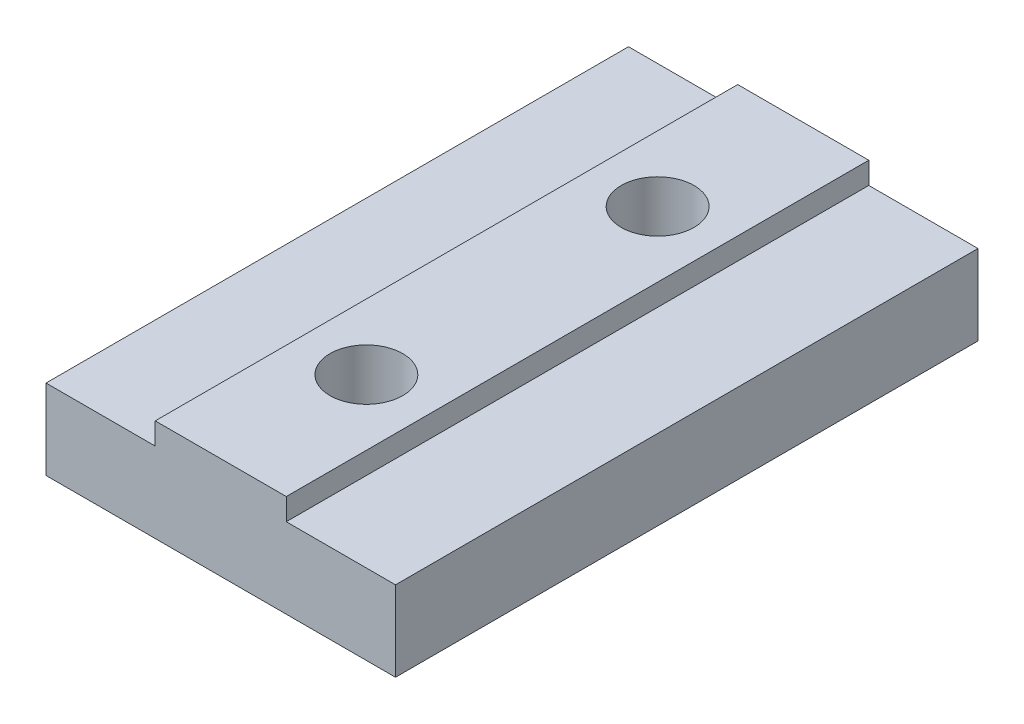
ISO-10303-21;
HEADER;
FILE_DESCRIPTION(('STEP AP214'),'2;1');
FILE_NAME('part.step','',(''),(''),'','','');
FILE_SCHEMA(('AUTOMOTIVE_DESIGN { 1 0 10303 214 1 1 1 1 }'));
ENDSEC;
DATA;
#1=APPLICATION_CONTEXT('core data for automotive mechanical design processes');
#2=APPLICATION_PROTOCOL_DEFINITION('international standard','automotive_design',2000,#1);
#3=PRODUCT_CONTEXT('',#1,'mechanical');
#4=PRODUCT('Part','Part','',(#3));
#5=PRODUCT_RELATED_PRODUCT_CATEGORY('part','',(#4));
#6=PRODUCT_DEFINITION_FORMATION('','',#4);
#7=PRODUCT_DEFINITION_CONTEXT('part definition',#1,'design');
#8=PRODUCT_DEFINITION('design','',#6,#7);
#9=PRODUCT_DEFINITION_SHAPE('','',#8);
#10=(LENGTH_UNIT() NAMED_UNIT(*) SI_UNIT(.MILLI.,.METRE.));
#11=(NAMED_UNIT(*) PLANE_ANGLE_UNIT() SI_UNIT($,.RADIAN.));
#12=(NAMED_UNIT(*) SI_UNIT($,.STERADIAN.) SOLID_ANGLE_UNIT());
#13=UNCERTAINTY_MEASURE_WITH_UNIT(LENGTH_MEASURE(1.E-05),#10,'distance_accuracy_value','');
#14=(GEOMETRIC_REPRESENTATION_CONTEXT(3) GLOBAL_UNCERTAINTY_ASSIGNED_CONTEXT((#13)) GLOBAL_UNIT_ASSIGNED_CONTEXT((#10,
#11,#12)) REPRESENTATION_CONTEXT('',''));
#15=CARTESIAN_POINT('',(0.,0.,0.));
#16=DIRECTION('',(0.,0.,1.));
#17=DIRECTION('',(1.,0.,0.));
#18=AXIS2_PLACEMENT_3D('',#15,#16,#17);
#19=CARTESIAN_POINT('',(0.,0.,40.));
#20=DIRECTION('',(1.,0.,0.));
#21=DIRECTION('',(0.,0.,-1.));
#22=AXIS2_PLACEMENT_3D('',#19,#20,#21);
#23=PLANE('',#22);
#24=DIRECTION('',(0.,-1.,0.));
#25=VECTOR('',#24,1.);
#26=CARTESIAN_POINT('',(0.,0.,0.));
#27=LINE('',#26,#25);
#28=CARTESIAN_POINT('',(0.,5.5,0.));
#29=VERTEX_POINT('',#28);
#30=CARTESIAN_POINT('',(0.,0.,0.));
#31=VERTEX_POINT('',#30);
#32=EDGE_CURVE('E140',#29,#31,#27,.T.);
#33=ORIENTED_EDGE('',*,*,#32,.T.);
#34=DIRECTION('',(0.,0.,-1.));
#35=VECTOR('',#34,1.);
#36=CARTESIAN_POINT('',(0.,0.,40.));
#37=LINE('',#36,#35);
#38=CARTESIAN_POINT('',(0.,0.,40.));
#39=VERTEX_POINT('',#38);
#40=EDGE_CURVE('E11',#39,#31,#37,.T.);
#41=ORIENTED_EDGE('',*,*,#40,.F.);
#42=DIRECTION('',(0.,-1.,0.));
#43=VECTOR('',#42,1.);
#44=CARTESIAN_POINT('',(0.,0.,40.));
#45=LINE('',#44,#43);
#46=CARTESIAN_POINT('',(0.,5.5,40.));
#47=VERTEX_POINT('',#46);
#48=EDGE_CURVE('E163',#47,#39,#45,.T.);
#49=ORIENTED_EDGE('',*,*,#48,.F.);
#50=DIRECTION('',(0.,0.,-1.));
#51=VECTOR('',#50,1.);
#52=CARTESIAN_POINT('',(0.,5.5,40.));
#53=LINE('',#52,#51);
#54=EDGE_CURVE('E136',#47,#29,#53,.T.);
#55=ORIENTED_EDGE('',*,*,#54,.T.);
#56=EDGE_LOOP('',(#33,#41,#49,#55));
#57=FACE_BOUND('',#56,.T.);
#58=ADVANCED_FACE('F39',(#57),#23,.F.);
#59=CARTESIAN_POINT('',(0.,0.,40.));
#60=DIRECTION('',(0.,1.,0.));
#61=DIRECTION('',(0.,0.,1.));
#62=AXIS2_PLACEMENT_3D('',#59,#60,#61);
#63=PLANE('',#62);
#64=CARTESIAN_POINT('',(12.,0.,10.));
#65=DIRECTION('',(0.,1.,0.));
#66=DIRECTION('',(0.,0.,1.));
#67=AXIS2_PLACEMENT_3D('',#64,#65,#66);
#68=CIRCLE('',#67,2.5);
#69=CARTESIAN_POINT('',(12.,0.,12.5));
#70=VERTEX_POINT('',#69);
#71=EDGE_CURVE('E145',#70,#70,#68,.T.);
#72=ORIENTED_EDGE('',*,*,#71,.T.);
#73=EDGE_LOOP('',(#72));
#74=FACE_BOUND('',#73,.T.);
#75=CARTESIAN_POINT('',(12.,0.,30.));
#76=DIRECTION('',(0.,1.,0.));
#77=DIRECTION('',(0.,0.,1.));
#78=AXIS2_PLACEMENT_3D('',#75,#76,#77);
#79=CIRCLE('',#78,2.5);
#80=CARTESIAN_POINT('',(12.,0.,32.5));
#81=VERTEX_POINT('',#80);
#82=EDGE_CURVE('E211',#81,#81,#79,.T.);
#83=ORIENTED_EDGE('',*,*,#82,.T.);
#84=EDGE_LOOP('',(#83));
#85=FACE_BOUND('',#84,.T.);
#86=DIRECTION('',(1.,0.,0.));
#87=VECTOR('',#86,1.);
#88=CARTESIAN_POINT('',(0.,0.,0.));
#89=LINE('',#88,#87);
#90=CARTESIAN_POINT('',(24.,0.,0.));
#91=VERTEX_POINT('',#90);
#92=EDGE_CURVE('E144',#31,#91,#89,.T.);
#93=ORIENTED_EDGE('',*,*,#92,.T.);
#94=DIRECTION('',(0.,0.,-1.));
#95=VECTOR('',#94,1.);
#96=CARTESIAN_POINT('',(24.,0.,40.));
#97=LINE('',#96,#95);
#98=CARTESIAN_POINT('',(24.,0.,40.));
#99=VERTEX_POINT('',#98);
#100=EDGE_CURVE('E48',#99,#91,#97,.T.);
#101=ORIENTED_EDGE('',*,*,#100,.F.);
#102=DIRECTION('',(1.,0.,0.));
#103=VECTOR('',#102,1.);
#104=CARTESIAN_POINT('',(0.,0.,40.));
#105=LINE('',#104,#103);
#106=EDGE_CURVE('E99',#39,#99,#105,.T.);
#107=ORIENTED_EDGE('',*,*,#106,.F.);
#108=ORIENTED_EDGE('',*,*,#40,.T.);
#109=EDGE_LOOP('',(#93,#101,#107,#108));
#110=FACE_BOUND('',#109,.T.);
#111=ADVANCED_FACE('F223',(#74,#85,#110),#63,.F.);
#112=CARTESIAN_POINT('',(24.,0.,40.));
#113=DIRECTION('',(-1.,0.,0.));
#114=DIRECTION('',(0.,0.,1.));
#115=AXIS2_PLACEMENT_3D('',#112,#113,#114);
#116=PLANE('',#115);
#117=DIRECTION('',(0.,1.,0.));
#118=VECTOR('',#117,1.);
#119=CARTESIAN_POINT('',(24.,0.,0.));
#120=LINE('',#119,#118);
#121=CARTESIAN_POINT('',(24.,5.5,0.));
#122=VERTEX_POINT('',#121);
#123=EDGE_CURVE('E148',#91,#122,#120,.T.);
#124=ORIENTED_EDGE('',*,*,#123,.T.);
#125=DIRECTION('',(0.,0.,-1.));
#126=VECTOR('',#125,1.);
#127=CARTESIAN_POINT('',(24.,5.5,40.));
#128=LINE('',#127,#126);
#129=CARTESIAN_POINT('',(24.,5.5,40.));
#130=VERTEX_POINT('',#129);
#131=EDGE_CURVE('E174',#130,#122,#128,.T.);
#132=ORIENTED_EDGE('',*,*,#131,.F.);
#133=DIRECTION('',(0.,1.,0.));
#134=VECTOR('',#133,1.);
#135=CARTESIAN_POINT('',(24.,0.,40.));
#136=LINE('',#135,#134);
#137=EDGE_CURVE('E184',#99,#130,#136,.T.);
#138=ORIENTED_EDGE('',*,*,#137,.F.);
#139=ORIENTED_EDGE('',*,*,#100,.T.);
#140=EDGE_LOOP('',(#124,#132,#138,#139));
#141=FACE_BOUND('',#140,.T.);
#142=ADVANCED_FACE('F182',(#141),#116,.F.);
#143=CARTESIAN_POINT('',(24.,5.5,40.));
#144=DIRECTION('',(0.,-1.,0.));
#145=DIRECTION('',(0.,0.,-1.));
#146=AXIS2_PLACEMENT_3D('',#143,#144,#145);
#147=PLANE('',#146);
#148=DIRECTION('',(-1.,0.,0.));
#149=VECTOR('',#148,1.);
#150=CARTESIAN_POINT('',(24.,5.5,0.));
#151=LINE('',#150,#149);
#152=CARTESIAN_POINT('',(16.5,5.5,0.));
#153=VERTEX_POINT('',#152);
#154=EDGE_CURVE('E151',#122,#153,#151,.T.);
#155=ORIENTED_EDGE('',*,*,#154,.T.);
#156=DIRECTION('',(0.,0.,-1.));
#157=VECTOR('',#156,1.);
#158=CARTESIAN_POINT('',(16.5,5.5,40.));
#159=LINE('',#158,#157);
#160=CARTESIAN_POINT('',(16.5,5.5,40.));
#161=VERTEX_POINT('',#160);
#162=EDGE_CURVE('E170',#161,#153,#159,.T.);
#163=ORIENTED_EDGE('',*,*,#162,.F.);
#164=DIRECTION('',(-1.,0.,0.));
#165=VECTOR('',#164,1.);
#166=CARTESIAN_POINT('',(24.,5.5,40.));
#167=LINE('',#166,#165);
#168=EDGE_CURVE('E197',#130,#161,#167,.T.);
#169=ORIENTED_EDGE('',*,*,#168,.F.);
#170=ORIENTED_EDGE('',*,*,#131,.T.);
#171=EDGE_LOOP('',(#155,#163,#169,#170));
#172=FACE_BOUND('',#171,.T.);
#173=ADVANCED_FACE('F192',(#172),#147,.F.);
#174=CARTESIAN_POINT('',(16.5,5.5,40.));
#175=DIRECTION('',(-1.,0.,0.));
#176=DIRECTION('',(0.,-1.,0.));
#177=AXIS2_PLACEMENT_3D('',#174,#175,#176);
#178=PLANE('',#177);
#179=DIRECTION('',(0.,1.,0.));
#180=VECTOR('',#179,1.);
#181=CARTESIAN_POINT('',(16.5,5.5,0.));
#182=LINE('',#181,#180);
#183=CARTESIAN_POINT('',(16.5,7.,0.));
#184=VERTEX_POINT('',#183);
#185=EDGE_CURVE('E154',#153,#184,#182,.T.);
#186=ORIENTED_EDGE('',*,*,#185,.T.);
#187=DIRECTION('',(0.,0.,-1.));
#188=VECTOR('',#187,1.);
#189=CARTESIAN_POINT('',(16.5,7.,40.));
#190=LINE('',#189,#188);
#191=CARTESIAN_POINT('',(16.5,7.,40.));
#192=VERTEX_POINT('',#191);
#193=EDGE_CURVE('E129',#192,#184,#190,.T.);
#194=ORIENTED_EDGE('',*,*,#193,.F.);
#195=DIRECTION('',(0.,1.,0.));
#196=VECTOR('',#195,1.);
#197=CARTESIAN_POINT('',(16.5,5.5,40.));
#198=LINE('',#197,#196);
#199=EDGE_CURVE('E118',#161,#192,#198,.T.);
#200=ORIENTED_EDGE('',*,*,#199,.F.);
#201=ORIENTED_EDGE('',*,*,#162,.T.);
#202=EDGE_LOOP('',(#186,#194,#200,#201));
#203=FACE_BOUND('',#202,.T.);
#204=ADVANCED_FACE('F195',(#203),#178,.F.);
#205=CARTESIAN_POINT('',(16.5,7.,40.));
#206=DIRECTION('',(0.,-1.,0.));
#207=DIRECTION('',(0.,0.,-1.));
#208=AXIS2_PLACEMENT_3D('',#205,#206,#207);
#209=PLANE('',#208);
#210=CARTESIAN_POINT('',(12.,7.,10.));
#211=DIRECTION('',(0.,1.,0.));
#212=DIRECTION('',(0.,0.,1.));
#213=AXIS2_PLACEMENT_3D('',#210,#211,#212);
#214=CIRCLE('',#213,2.5);
#215=CARTESIAN_POINT('',(12.,7.,12.5));
#216=VERTEX_POINT('',#215);
#217=EDGE_CURVE('E215',#216,#216,#214,.T.);
#218=ORIENTED_EDGE('',*,*,#217,.F.);
#219=EDGE_LOOP('',(#218));
#220=FACE_BOUND('',#219,.T.);
#221=CARTESIAN_POINT('',(12.,7.,30.));
#222=DIRECTION('',(0.,1.,0.));
#223=DIRECTION('',(0.,0.,1.));
#224=AXIS2_PLACEMENT_3D('',#221,#222,#223);
#225=CIRCLE('',#224,2.5);
#226=CARTESIAN_POINT('',(12.,7.,32.5));
#227=VERTEX_POINT('',#226);
#228=EDGE_CURVE('E207',#227,#227,#225,.T.);
#229=ORIENTED_EDGE('',*,*,#228,.F.);
#230=EDGE_LOOP('',(#229));
#231=FACE_BOUND('',#230,.T.);
#232=DIRECTION('',(-1.,0.,0.));
#233=VECTOR('',#232,1.);
#234=CARTESIAN_POINT('',(16.5,7.,0.));
#235=LINE('',#234,#233);
#236=CARTESIAN_POINT('',(7.5,7.,0.));
#237=VERTEX_POINT('',#236);
#238=EDGE_CURVE('E127',#184,#237,#235,.T.);
#239=ORIENTED_EDGE('',*,*,#238,.T.);
#240=DIRECTION('',(0.,0.,-1.));
#241=VECTOR('',#240,1.);
#242=CARTESIAN_POINT('',(7.5,7.,40.));
#243=LINE('',#242,#241);
#244=CARTESIAN_POINT('',(7.5,7.,40.));
#245=VERTEX_POINT('',#244);
#246=EDGE_CURVE('E124',#245,#237,#243,.T.);
#247=ORIENTED_EDGE('',*,*,#246,.F.);
#248=DIRECTION('',(-1.,0.,0.));
#249=VECTOR('',#248,1.);
#250=CARTESIAN_POINT('',(16.5,7.,40.));
#251=LINE('',#250,#249);
#252=EDGE_CURVE('E112',#192,#245,#251,.T.);
#253=ORIENTED_EDGE('',*,*,#252,.F.);
#254=ORIENTED_EDGE('',*,*,#193,.T.);
#255=EDGE_LOOP('',(#239,#247,#253,#254));
#256=FACE_BOUND('',#255,.T.);
#257=ADVANCED_FACE('F125',(#220,#231,#256),#209,.F.);
#258=CARTESIAN_POINT('',(7.5,7.,40.));
#259=DIRECTION('',(1.,0.,0.));
#260=DIRECTION('',(0.,0.,-1.));
#261=AXIS2_PLACEMENT_3D('',#258,#259,#260);
#262=PLANE('',#261);
#263=DIRECTION('',(0.,-1.,0.));
#264=VECTOR('',#263,1.);
#265=CARTESIAN_POINT('',(7.5,7.,0.));
#266=LINE('',#265,#264);
#267=CARTESIAN_POINT('',(7.5,5.5,0.));
#268=VERTEX_POINT('',#267);
#269=EDGE_CURVE('E85',#237,#268,#266,.T.);
#270=ORIENTED_EDGE('',*,*,#269,.T.);
#271=DIRECTION('',(0.,0.,-1.));
#272=VECTOR('',#271,1.);
#273=CARTESIAN_POINT('',(7.5,5.5,40.));
#274=LINE('',#273,#272);
#275=CARTESIAN_POINT('',(7.5,5.5,40.));
#276=VERTEX_POINT('',#275);
#277=EDGE_CURVE('E130',#276,#268,#274,.T.);
#278=ORIENTED_EDGE('',*,*,#277,.F.);
#279=DIRECTION('',(0.,-1.,0.));
#280=VECTOR('',#279,1.);
#281=CARTESIAN_POINT('',(7.5,7.,40.));
#282=LINE('',#281,#280);
#283=EDGE_CURVE('E116',#245,#276,#282,.T.);
#284=ORIENTED_EDGE('',*,*,#283,.F.);
#285=ORIENTED_EDGE('',*,*,#246,.T.);
#286=EDGE_LOOP('',(#270,#278,#284,#285));
#287=FACE_BOUND('',#286,.T.);
#288=ADVANCED_FACE('F132',(#287),#262,.F.);
#289=CARTESIAN_POINT('',(7.5,5.5,40.));
#290=DIRECTION('',(0.,-1.,0.));
#291=DIRECTION('',(1.,0.,0.));
#292=AXIS2_PLACEMENT_3D('',#289,#290,#291);
#293=PLANE('',#292);
#294=DIRECTION('',(-1.,0.,0.));
#295=VECTOR('',#294,1.);
#296=CARTESIAN_POINT('',(7.5,5.5,0.));
#297=LINE('',#296,#295);
#298=EDGE_CURVE('E91',#268,#29,#297,.T.);
#299=ORIENTED_EDGE('',*,*,#298,.T.);
#300=ORIENTED_EDGE('',*,*,#54,.F.);
#301=DIRECTION('',(-1.,0.,0.));
#302=VECTOR('',#301,1.);
#303=CARTESIAN_POINT('',(7.5,5.5,40.));
#304=LINE('',#303,#302);
#305=EDGE_CURVE('E56',#276,#47,#304,.T.);
#306=ORIENTED_EDGE('',*,*,#305,.F.);
#307=ORIENTED_EDGE('',*,*,#277,.T.);
#308=EDGE_LOOP('',(#299,#300,#306,#307));
#309=FACE_BOUND('',#308,.T.);
#310=ADVANCED_FACE('F254',(#309),#293,.F.);
#311=CARTESIAN_POINT('',(0.,0.,40.));
#312=DIRECTION('',(0.,0.,1.));
#313=DIRECTION('',(1.,0.,0.));
#314=AXIS2_PLACEMENT_3D('',#311,#312,#313);
#315=PLANE('',#314);
#316=ORIENTED_EDGE('',*,*,#48,.T.);
#317=ORIENTED_EDGE('',*,*,#106,.T.);
#318=ORIENTED_EDGE('',*,*,#137,.T.);
#319=ORIENTED_EDGE('',*,*,#168,.T.);
#320=ORIENTED_EDGE('',*,*,#199,.T.);
#321=ORIENTED_EDGE('',*,*,#252,.T.);
#322=ORIENTED_EDGE('',*,*,#283,.T.);
#323=ORIENTED_EDGE('',*,*,#305,.T.);
#324=EDGE_LOOP('',(#316,#317,#318,#319,#320,#321,#322,#323));
#325=FACE_BOUND('',#324,.T.);
#326=ADVANCED_FACE('F114',(#325),#315,.T.);
#327=CARTESIAN_POINT('',(0.,0.,0.));
#328=DIRECTION('',(0.,0.,1.));
#329=DIRECTION('',(1.,0.,0.));
#330=AXIS2_PLACEMENT_3D('',#327,#328,#329);
#331=PLANE('',#330);
#332=ORIENTED_EDGE('',*,*,#32,.F.);
#333=ORIENTED_EDGE('',*,*,#298,.F.);
#334=ORIENTED_EDGE('',*,*,#269,.F.);
#335=ORIENTED_EDGE('',*,*,#238,.F.);
#336=ORIENTED_EDGE('',*,*,#185,.F.);
#337=ORIENTED_EDGE('',*,*,#154,.F.);
#338=ORIENTED_EDGE('',*,*,#123,.F.);
#339=ORIENTED_EDGE('',*,*,#92,.F.);
#340=EDGE_LOOP('',(#332,#333,#334,#335,#336,#337,#338,#339));
#341=FACE_BOUND('',#340,.T.);
#342=ADVANCED_FACE('F188',(#341),#331,.F.);
#343=CARTESIAN_POINT('',(12.,0.,30.));
#344=DIRECTION('',(0.,1.,0.));
#345=DIRECTION('',(0.,0.,1.));
#346=AXIS2_PLACEMENT_3D('',#343,#344,#345);
#347=CYLINDRICAL_SURFACE('',#346,2.5);
#348=ORIENTED_EDGE('',*,*,#82,.F.);
#349=EDGE_LOOP('',(#348));
#350=FACE_BOUND('',#349,.T.);
#351=ORIENTED_EDGE('',*,*,#228,.T.);
#352=EDGE_LOOP('',(#351));
#353=FACE_BOUND('',#352,.T.);
#354=ADVANCED_FACE('F229',(#350,#353),#347,.F.);
#355=CARTESIAN_POINT('',(12.,0.,10.));
#356=DIRECTION('',(0.,1.,0.));
#357=DIRECTION('',(0.,0.,1.));
#358=AXIS2_PLACEMENT_3D('',#355,#356,#357);
#359=CYLINDRICAL_SURFACE('',#358,2.5);
#360=ORIENTED_EDGE('',*,*,#71,.F.);
#361=EDGE_LOOP('',(#360));
#362=FACE_BOUND('',#361,.T.);
#363=ORIENTED_EDGE('',*,*,#217,.T.);
#364=EDGE_LOOP('',(#363));
#365=FACE_BOUND('',#364,.T.);
#366=ADVANCED_FACE('F226',(#362,#365),#359,.F.);
#367=CLOSED_SHELL('',(#58,#111,#142,#173,#204,#257,#288,#310,#326,#342,#354,#366));
#368=MANIFOLD_SOLID_BREP('B2',#367);
#369=ADVANCED_BREP_SHAPE_REPRESENTATION('',(#18,#368),#14);
#370=SHAPE_DEFINITION_REPRESENTATION(#9,#369);
ENDSEC;
END-ISO-10303-21;
